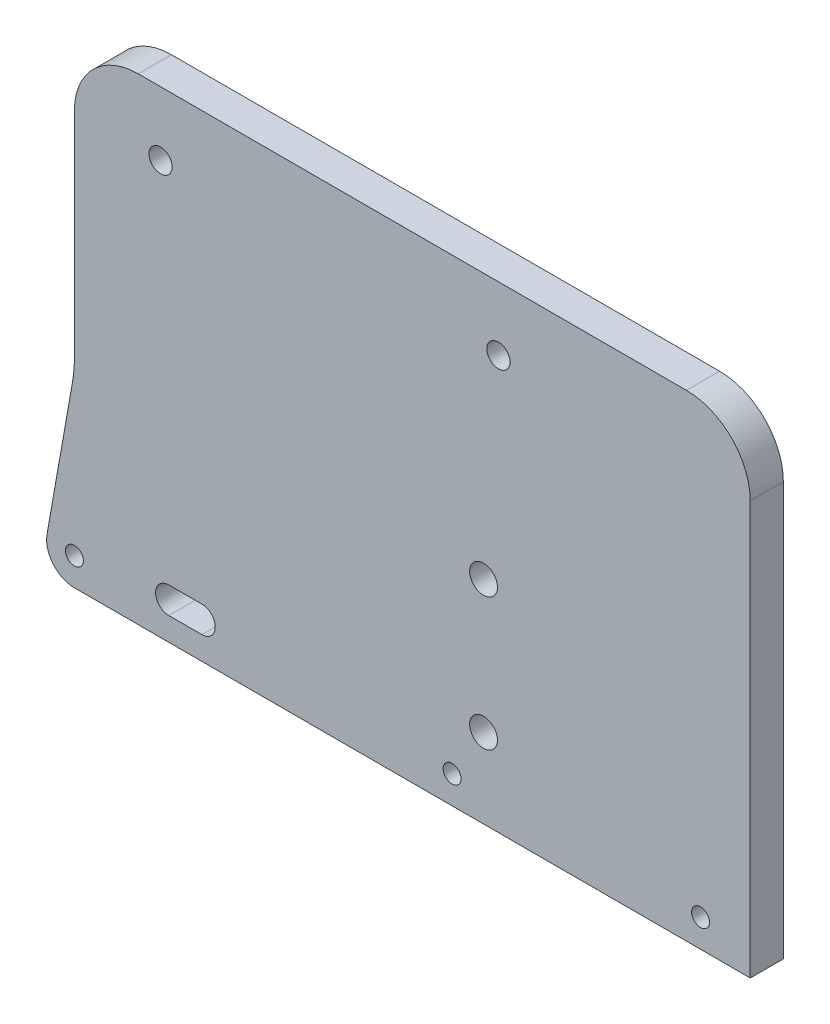
ISO-10303-21;
HEADER;
FILE_DESCRIPTION(('STEP AP214'),'2;1');
FILE_NAME('part.step','',(''),(''),'','','');
FILE_SCHEMA(('AUTOMOTIVE_DESIGN { 1 0 10303 214 1 1 1 1 }'));
ENDSEC;
DATA;
#1=APPLICATION_CONTEXT('core data for automotive mechanical design processes');
#2=APPLICATION_PROTOCOL_DEFINITION('international standard','automotive_design',2000,#1);
#3=PRODUCT_CONTEXT('',#1,'mechanical');
#4=PRODUCT('Part','Part','',(#3));
#5=PRODUCT_RELATED_PRODUCT_CATEGORY('part','',(#4));
#6=PRODUCT_DEFINITION_FORMATION('','',#4);
#7=PRODUCT_DEFINITION_CONTEXT('part definition',#1,'design');
#8=PRODUCT_DEFINITION('design','',#6,#7);
#9=PRODUCT_DEFINITION_SHAPE('','',#8);
#10=(LENGTH_UNIT() NAMED_UNIT(*) SI_UNIT(.MILLI.,.METRE.));
#11=(NAMED_UNIT(*) PLANE_ANGLE_UNIT() SI_UNIT($,.RADIAN.));
#12=(NAMED_UNIT(*) SI_UNIT($,.STERADIAN.) SOLID_ANGLE_UNIT());
#13=UNCERTAINTY_MEASURE_WITH_UNIT(LENGTH_MEASURE(1.E-05),#10,'distance_accuracy_value','');
#14=(GEOMETRIC_REPRESENTATION_CONTEXT(3) GLOBAL_UNCERTAINTY_ASSIGNED_CONTEXT((#13)) GLOBAL_UNIT_ASSIGNED_CONTEXT((#10,
#11,#12)) REPRESENTATION_CONTEXT('',''));
#15=CARTESIAN_POINT('',(0.,0.,0.));
#16=DIRECTION('',(0.,0.,1.));
#17=DIRECTION('',(1.,0.,0.));
#18=AXIS2_PLACEMENT_3D('',#15,#16,#17);
#19=CARTESIAN_POINT('',(30.62,50.37,5.));
#20=DIRECTION('',(0.,0.,1.));
#21=DIRECTION('',(1.,0.,0.));
#22=AXIS2_PLACEMENT_3D('',#19,#20,#21);
#23=PLANE('',#22);
#24=CARTESIAN_POINT('',(0.,20.,5.));
#25=DIRECTION('',(0.,0.,1.));
#26=DIRECTION('',(1.,0.,0.));
#27=AXIS2_PLACEMENT_3D('',#24,#25,#26);
#28=CIRCLE('',#27,2.1);
#29=CARTESIAN_POINT('',(2.1,20.,5.));
#30=VERTEX_POINT('',#29);
#31=EDGE_CURVE('E191',#30,#30,#28,.T.);
#32=ORIENTED_EDGE('',*,*,#31,.F.);
#33=EDGE_LOOP('',(#32));
#34=FACE_BOUND('',#33,.T.);
#35=CARTESIAN_POINT('',(-61.75,-7.8,5.));
#36=DIRECTION('',(0.,0.,1.));
#37=DIRECTION('',(1.,0.,0.));
#38=AXIS2_PLACEMENT_3D('',#35,#36,#37);
#39=CIRCLE('',#38,1.35);
#40=CARTESIAN_POINT('',(-60.4,-7.8,5.));
#41=VERTEX_POINT('',#40);
#42=EDGE_CURVE('E207',#41,#41,#39,.T.);
#43=ORIENTED_EDGE('',*,*,#42,.F.);
#44=EDGE_LOOP('',(#43));
#45=FACE_BOUND('',#44,.T.);
#46=CARTESIAN_POINT('',(2.25,50.37,5.));
#47=DIRECTION('',(0.,0.,1.));
#48=DIRECTION('',(-1.,0.,0.));
#49=AXIS2_PLACEMENT_3D('',#46,#47,#48);
#50=CIRCLE('',#49,1.75);
#51=CARTESIAN_POINT('',(0.499999999999995,50.37,5.));
#52=VERTEX_POINT('',#51);
#53=EDGE_CURVE('E219',#52,#52,#50,.T.);
#54=ORIENTED_EDGE('',*,*,#53,.F.);
#55=EDGE_LOOP('',(#54));
#56=FACE_BOUND('',#55,.T.);
#57=CARTESIAN_POINT('',(0.,0.,5.));
#58=DIRECTION('',(0.,0.,1.));
#59=DIRECTION('',(1.,0.,0.));
#60=AXIS2_PLACEMENT_3D('',#57,#58,#59);
#61=CIRCLE('',#60,2.1);
#62=CARTESIAN_POINT('',(2.1,0.,5.));
#63=VERTEX_POINT('',#62);
#64=EDGE_CURVE('E235',#63,#63,#61,.T.);
#65=ORIENTED_EDGE('',*,*,#64,.F.);
#66=EDGE_LOOP('',(#65));
#67=FACE_BOUND('',#66,.T.);
#68=CARTESIAN_POINT('',(30.62,50.37,5.));
#69=DIRECTION('',(0.,0.,1.));
#70=DIRECTION('',(1.,0.,0.));
#71=AXIS2_PLACEMENT_3D('',#68,#69,#70);
#72=CIRCLE('',#71,9.63);
#73=CARTESIAN_POINT('',(40.25,50.37,5.));
#74=VERTEX_POINT('',#73);
#75=CARTESIAN_POINT('',(30.62,60.,5.));
#76=VERTEX_POINT('',#75);
#77=EDGE_CURVE('E243',#74,#76,#72,.T.);
#78=ORIENTED_EDGE('',*,*,#77,.T.);
#79=DIRECTION('',(-1.,0.,0.));
#80=VECTOR('',#79,1.);
#81=CARTESIAN_POINT('',(-52.12,60.,5.));
#82=LINE('',#81,#80);
#83=CARTESIAN_POINT('',(-52.12,60.,5.));
#84=VERTEX_POINT('',#83);
#85=EDGE_CURVE('E246',#76,#84,#82,.T.);
#86=ORIENTED_EDGE('',*,*,#85,.T.);
#87=CARTESIAN_POINT('',(-52.12,50.37,5.));
#88=DIRECTION('',(0.,0.,1.));
#89=DIRECTION('',(1.,0.,0.));
#90=AXIS2_PLACEMENT_3D('',#87,#88,#89);
#91=CIRCLE('',#90,9.63);
#92=CARTESIAN_POINT('',(-61.75,50.37,5.));
#93=VERTEX_POINT('',#92);
#94=EDGE_CURVE('E250',#84,#93,#91,.T.);
#95=ORIENTED_EDGE('',*,*,#94,.T.);
#96=DIRECTION('',(0.,-1.,0.));
#97=VECTOR('',#96,1.);
#98=CARTESIAN_POINT('',(-61.75,18.1366092997226,5.));
#99=LINE('',#98,#97);
#100=CARTESIAN_POINT('',(-61.75,18.1366092997226,5.));
#101=VERTEX_POINT('',#100);
#102=EDGE_CURVE('E253',#93,#101,#99,.T.);
#103=ORIENTED_EDGE('',*,*,#102,.T.);
#104=CARTESIAN_POINT('',(-81.75,18.1366092997226,5.));
#105=DIRECTION('',(0.,0.,-1.));
#106=DIRECTION('',(1.,0.,0.));
#107=AXIS2_PLACEMENT_3D('',#104,#105,#106);
#108=CIRCLE('',#107,20.);
#109=CARTESIAN_POINT('',(-62.0538449397558,14.6636457463841,5.));
#110=VERTEX_POINT('',#109);
#111=EDGE_CURVE('E256',#101,#110,#108,.T.);
#112=ORIENTED_EDGE('',*,*,#111,.T.);
#113=DIRECTION('',(-0.173648177666923,-0.984807753012209,0.));
#114=VECTOR('',#113,1.);
#115=CARTESIAN_POINT('',(-62.0538449397558,14.6636457463841,5.));
#116=LINE('',#115,#114);
#117=CARTESIAN_POINT('',(-65.8861925626513,-7.07067765379892,5.));
#118=VERTEX_POINT('',#117);
#119=EDGE_CURVE('E259',#110,#118,#116,.T.);
#120=ORIENTED_EDGE('',*,*,#119,.T.);
#121=CARTESIAN_POINT('',(-61.75,-7.8,5.));
#122=DIRECTION('',(0.,0.,1.));
#123=DIRECTION('',(1.,0.,0.));
#124=AXIS2_PLACEMENT_3D('',#121,#122,#123);
#125=CIRCLE('',#124,4.2);
#126=CARTESIAN_POINT('',(-61.75,-12.,5.));
#127=VERTEX_POINT('',#126);
#128=EDGE_CURVE('E262',#118,#127,#125,.T.);
#129=ORIENTED_EDGE('',*,*,#128,.T.);
#130=DIRECTION('',(1.,0.,0.));
#131=VECTOR('',#130,1.);
#132=CARTESIAN_POINT('',(-61.75,-12.,5.));
#133=LINE('',#132,#131);
#134=CARTESIAN_POINT('',(40.25,-12.,5.));
#135=VERTEX_POINT('',#134);
#136=EDGE_CURVE('E264',#127,#135,#133,.T.);
#137=ORIENTED_EDGE('',*,*,#136,.T.);
#138=DIRECTION('',(0.,1.,0.));
#139=VECTOR('',#138,1.);
#140=CARTESIAN_POINT('',(40.25,-12.,5.));
#141=LINE('',#140,#139);
#142=EDGE_CURVE('E267',#135,#74,#141,.T.);
#143=ORIENTED_EDGE('',*,*,#142,.T.);
#144=EDGE_LOOP('',(#78,#86,#95,#103,#112,#120,#129,#137,#143));
#145=FACE_BOUND('',#144,.T.);
#146=CARTESIAN_POINT('',(-48.75,50.37,5.));
#147=DIRECTION('',(0.,0.,1.));
#148=DIRECTION('',(1.,0.,0.));
#149=AXIS2_PLACEMENT_3D('',#146,#147,#148);
#150=CIRCLE('',#149,1.75);
#151=CARTESIAN_POINT('',(-47.,50.37,5.));
#152=VERTEX_POINT('',#151);
#153=EDGE_CURVE('E227',#152,#152,#150,.T.);
#154=ORIENTED_EDGE('',*,*,#153,.F.);
#155=EDGE_LOOP('',(#154));
#156=FACE_BOUND('',#155,.T.);
#157=CARTESIAN_POINT('',(32.75,-7.8,5.));
#158=DIRECTION('',(0.,0.,1.));
#159=DIRECTION('',(1.,0.,0.));
#160=AXIS2_PLACEMENT_3D('',#157,#158,#159);
#161=CIRCLE('',#160,1.35);
#162=CARTESIAN_POINT('',(34.1,-7.8,5.));
#163=VERTEX_POINT('',#162);
#164=EDGE_CURVE('E213',#163,#163,#161,.T.);
#165=ORIENTED_EDGE('',*,*,#164,.F.);
#166=EDGE_LOOP('',(#165));
#167=FACE_BOUND('',#166,.T.);
#168=CARTESIAN_POINT('',(-4.75,-7.8,5.));
#169=DIRECTION('',(0.,0.,1.));
#170=DIRECTION('',(1.,0.,0.));
#171=AXIS2_PLACEMENT_3D('',#168,#169,#170);
#172=CIRCLE('',#171,1.35);
#173=CARTESIAN_POINT('',(-3.4,-7.8,5.));
#174=VERTEX_POINT('',#173);
#175=EDGE_CURVE('E199',#174,#174,#172,.T.);
#176=ORIENTED_EDGE('',*,*,#175,.F.);
#177=EDGE_LOOP('',(#176));
#178=FACE_BOUND('',#177,.T.);
#179=DIRECTION('',(1.,0.,0.));
#180=VECTOR('',#179,1.);
#181=CARTESIAN_POINT('',(-47.5,-8.5,5.));
#182=LINE('',#181,#180);
#183=CARTESIAN_POINT('',(-47.5,-8.5,5.));
#184=VERTEX_POINT('',#183);
#185=CARTESIAN_POINT('',(-42.5,-8.5,5.));
#186=VERTEX_POINT('',#185);
#187=EDGE_CURVE('E156',#184,#186,#182,.T.);
#188=ORIENTED_EDGE('',*,*,#187,.F.);
#189=CARTESIAN_POINT('',(-47.5,-6.5,5.));
#190=DIRECTION('',(0.,0.,1.));
#191=DIRECTION('',(1.,0.,0.));
#192=AXIS2_PLACEMENT_3D('',#189,#190,#191);
#193=CIRCLE('',#192,2.);
#194=CARTESIAN_POINT('',(-47.5,-4.5,5.));
#195=VERTEX_POINT('',#194);
#196=EDGE_CURVE('E148',#195,#184,#193,.T.);
#197=ORIENTED_EDGE('',*,*,#196,.F.);
#198=DIRECTION('',(-1.,0.,0.));
#199=VECTOR('',#198,1.);
#200=CARTESIAN_POINT('',(-47.5,-4.5,5.));
#201=LINE('',#200,#199);
#202=CARTESIAN_POINT('',(-42.5,-4.5,5.));
#203=VERTEX_POINT('',#202);
#204=EDGE_CURVE('E171',#203,#195,#201,.T.);
#205=ORIENTED_EDGE('',*,*,#204,.F.);
#206=CARTESIAN_POINT('',(-42.5,-6.5,5.));
#207=DIRECTION('',(0.,0.,1.));
#208=DIRECTION('',(1.,0.,0.));
#209=AXIS2_PLACEMENT_3D('',#206,#207,#208);
#210=CIRCLE('',#209,2.);
#211=EDGE_CURVE('E168',#186,#203,#210,.T.);
#212=ORIENTED_EDGE('',*,*,#211,.F.);
#213=EDGE_LOOP('',(#188,#197,#205,#212));
#214=FACE_BOUND('',#213,.T.);
#215=ADVANCED_FACE('F41',(#34,#45,#56,#67,#145,#156,#167,#178,#214),#23,.T.);
#216=CARTESIAN_POINT('',(30.62,50.37,0.));
#217=DIRECTION('',(0.,0.,1.));
#218=DIRECTION('',(1.,0.,0.));
#219=AXIS2_PLACEMENT_3D('',#216,#217,#218);
#220=PLANE('',#219);
#221=CARTESIAN_POINT('',(0.,20.,0.));
#222=DIRECTION('',(0.,0.,1.));
#223=DIRECTION('',(1.,0.,0.));
#224=AXIS2_PLACEMENT_3D('',#221,#222,#223);
#225=CIRCLE('',#224,2.1);
#226=CARTESIAN_POINT('',(2.1,20.,0.));
#227=VERTEX_POINT('',#226);
#228=EDGE_CURVE('E164',#227,#227,#225,.T.);
#229=ORIENTED_EDGE('',*,*,#228,.T.);
#230=EDGE_LOOP('',(#229));
#231=FACE_BOUND('',#230,.T.);
#232=CARTESIAN_POINT('',(-61.75,-7.8,0.));
#233=DIRECTION('',(0.,0.,1.));
#234=DIRECTION('',(1.,0.,0.));
#235=AXIS2_PLACEMENT_3D('',#232,#233,#234);
#236=CIRCLE('',#235,1.35);
#237=CARTESIAN_POINT('',(-60.4,-7.8,0.));
#238=VERTEX_POINT('',#237);
#239=EDGE_CURVE('E203',#238,#238,#236,.T.);
#240=ORIENTED_EDGE('',*,*,#239,.T.);
#241=EDGE_LOOP('',(#240));
#242=FACE_BOUND('',#241,.T.);
#243=CARTESIAN_POINT('',(2.25,50.37,0.));
#244=DIRECTION('',(0.,0.,1.));
#245=DIRECTION('',(-1.,0.,0.));
#246=AXIS2_PLACEMENT_3D('',#243,#244,#245);
#247=CIRCLE('',#246,1.75);
#248=CARTESIAN_POINT('',(0.499999999999995,50.37,0.));
#249=VERTEX_POINT('',#248);
#250=EDGE_CURVE('E216',#249,#249,#247,.T.);
#251=ORIENTED_EDGE('',*,*,#250,.T.);
#252=EDGE_LOOP('',(#251));
#253=FACE_BOUND('',#252,.T.);
#254=CARTESIAN_POINT('',(0.,0.,0.));
#255=DIRECTION('',(0.,0.,1.));
#256=DIRECTION('',(1.,0.,0.));
#257=AXIS2_PLACEMENT_3D('',#254,#255,#256);
#258=CIRCLE('',#257,2.1);
#259=CARTESIAN_POINT('',(2.1,0.,0.));
#260=VERTEX_POINT('',#259);
#261=EDGE_CURVE('E231',#260,#260,#258,.T.);
#262=ORIENTED_EDGE('',*,*,#261,.T.);
#263=EDGE_LOOP('',(#262));
#264=FACE_BOUND('',#263,.T.);
#265=CARTESIAN_POINT('',(30.62,50.37,0.));
#266=DIRECTION('',(0.,0.,1.));
#267=DIRECTION('',(1.,0.,0.));
#268=AXIS2_PLACEMENT_3D('',#265,#266,#267);
#269=CIRCLE('',#268,9.63);
#270=CARTESIAN_POINT('',(40.25,50.37,0.));
#271=VERTEX_POINT('',#270);
#272=CARTESIAN_POINT('',(30.62,60.,0.));
#273=VERTEX_POINT('',#272);
#274=EDGE_CURVE('E239',#271,#273,#269,.T.);
#275=ORIENTED_EDGE('',*,*,#274,.F.);
#276=DIRECTION('',(0.,1.,0.));
#277=VECTOR('',#276,1.);
#278=CARTESIAN_POINT('',(40.25,-12.,0.));
#279=LINE('',#278,#277);
#280=CARTESIAN_POINT('',(40.25,-12.,0.));
#281=VERTEX_POINT('',#280);
#282=EDGE_CURVE('E247',#281,#271,#279,.T.);
#283=ORIENTED_EDGE('',*,*,#282,.F.);
#284=DIRECTION('',(1.,0.,0.));
#285=VECTOR('',#284,1.);
#286=CARTESIAN_POINT('',(-61.75,-12.,0.));
#287=LINE('',#286,#285);
#288=CARTESIAN_POINT('',(-61.75,-12.,0.));
#289=VERTEX_POINT('',#288);
#290=EDGE_CURVE('E290',#289,#281,#287,.T.);
#291=ORIENTED_EDGE('',*,*,#290,.F.);
#292=CARTESIAN_POINT('',(-61.75,-7.8,0.));
#293=DIRECTION('',(0.,0.,1.));
#294=DIRECTION('',(1.,0.,0.));
#295=AXIS2_PLACEMENT_3D('',#292,#293,#294);
#296=CIRCLE('',#295,4.2);
#297=CARTESIAN_POINT('',(-65.8861925626513,-7.07067765379892,0.));
#298=VERTEX_POINT('',#297);
#299=EDGE_CURVE('E288',#298,#289,#296,.T.);
#300=ORIENTED_EDGE('',*,*,#299,.F.);
#301=DIRECTION('',(-0.173648177666923,-0.984807753012209,0.));
#302=VECTOR('',#301,1.);
#303=CARTESIAN_POINT('',(-62.0538449397558,14.6636457463841,0.));
#304=LINE('',#303,#302);
#305=CARTESIAN_POINT('',(-62.0538449397558,14.6636457463841,0.));
#306=VERTEX_POINT('',#305);
#307=EDGE_CURVE('E285',#306,#298,#304,.T.);
#308=ORIENTED_EDGE('',*,*,#307,.F.);
#309=CARTESIAN_POINT('',(-81.75,18.1366092997226,0.));
#310=DIRECTION('',(0.,0.,-1.));
#311=DIRECTION('',(1.,0.,0.));
#312=AXIS2_PLACEMENT_3D('',#309,#310,#311);
#313=CIRCLE('',#312,20.);
#314=CARTESIAN_POINT('',(-61.75,18.1366092997226,0.));
#315=VERTEX_POINT('',#314);
#316=EDGE_CURVE('E282',#315,#306,#313,.T.);
#317=ORIENTED_EDGE('',*,*,#316,.F.);
#318=DIRECTION('',(0.,-1.,0.));
#319=VECTOR('',#318,1.);
#320=CARTESIAN_POINT('',(-61.75,18.1366092997226,0.));
#321=LINE('',#320,#319);
#322=CARTESIAN_POINT('',(-61.75,50.37,0.));
#323=VERTEX_POINT('',#322);
#324=EDGE_CURVE('E279',#323,#315,#321,.T.);
#325=ORIENTED_EDGE('',*,*,#324,.F.);
#326=CARTESIAN_POINT('',(-52.12,50.37,0.));
#327=DIRECTION('',(0.,0.,1.));
#328=DIRECTION('',(1.,0.,0.));
#329=AXIS2_PLACEMENT_3D('',#326,#327,#328);
#330=CIRCLE('',#329,9.63);
#331=CARTESIAN_POINT('',(-52.12,60.,0.));
#332=VERTEX_POINT('',#331);
#333=EDGE_CURVE('E276',#332,#323,#330,.T.);
#334=ORIENTED_EDGE('',*,*,#333,.F.);
#335=DIRECTION('',(-1.,0.,0.));
#336=VECTOR('',#335,1.);
#337=CARTESIAN_POINT('',(-52.12,60.,0.));
#338=LINE('',#337,#336);
#339=EDGE_CURVE('E273',#273,#332,#338,.T.);
#340=ORIENTED_EDGE('',*,*,#339,.F.);
#341=EDGE_LOOP('',(#275,#283,#291,#300,#308,#317,#325,#334,#340));
#342=FACE_BOUND('',#341,.T.);
#343=CARTESIAN_POINT('',(-48.75,50.37,0.));
#344=DIRECTION('',(0.,0.,1.));
#345=DIRECTION('',(1.,0.,0.));
#346=AXIS2_PLACEMENT_3D('',#343,#344,#345);
#347=CIRCLE('',#346,1.75);
#348=CARTESIAN_POINT('',(-47.,50.37,0.));
#349=VERTEX_POINT('',#348);
#350=EDGE_CURVE('E223',#349,#349,#347,.T.);
#351=ORIENTED_EDGE('',*,*,#350,.T.);
#352=EDGE_LOOP('',(#351));
#353=FACE_BOUND('',#352,.T.);
#354=CARTESIAN_POINT('',(32.75,-7.8,0.));
#355=DIRECTION('',(0.,0.,1.));
#356=DIRECTION('',(1.,0.,0.));
#357=AXIS2_PLACEMENT_3D('',#354,#355,#356);
#358=CIRCLE('',#357,1.35);
#359=CARTESIAN_POINT('',(34.1,-7.8,0.));
#360=VERTEX_POINT('',#359);
#361=EDGE_CURVE('E210',#360,#360,#358,.T.);
#362=ORIENTED_EDGE('',*,*,#361,.T.);
#363=EDGE_LOOP('',(#362));
#364=FACE_BOUND('',#363,.T.);
#365=CARTESIAN_POINT('',(-4.75,-7.8,0.));
#366=DIRECTION('',(0.,0.,1.));
#367=DIRECTION('',(1.,0.,0.));
#368=AXIS2_PLACEMENT_3D('',#365,#366,#367);
#369=CIRCLE('',#368,1.35);
#370=CARTESIAN_POINT('',(-3.4,-7.8,0.));
#371=VERTEX_POINT('',#370);
#372=EDGE_CURVE('E195',#371,#371,#369,.T.);
#373=ORIENTED_EDGE('',*,*,#372,.T.);
#374=EDGE_LOOP('',(#373));
#375=FACE_BOUND('',#374,.T.);
#376=CARTESIAN_POINT('',(-47.5,-6.5,0.));
#377=DIRECTION('',(0.,0.,1.));
#378=DIRECTION('',(1.,0.,0.));
#379=AXIS2_PLACEMENT_3D('',#376,#377,#378);
#380=CIRCLE('',#379,2.);
#381=CARTESIAN_POINT('',(-47.5,-4.5,0.));
#382=VERTEX_POINT('',#381);
#383=CARTESIAN_POINT('',(-47.5,-8.5,0.));
#384=VERTEX_POINT('',#383);
#385=EDGE_CURVE('E69',#382,#384,#380,.T.);
#386=ORIENTED_EDGE('',*,*,#385,.T.);
#387=DIRECTION('',(1.,0.,0.));
#388=VECTOR('',#387,1.);
#389=CARTESIAN_POINT('',(-47.5,-8.5,0.));
#390=LINE('',#389,#388);
#391=CARTESIAN_POINT('',(-42.5,-8.5,0.));
#392=VERTEX_POINT('',#391);
#393=EDGE_CURVE('E163',#384,#392,#390,.T.);
#394=ORIENTED_EDGE('',*,*,#393,.T.);
#395=CARTESIAN_POINT('',(-42.5,-6.5,0.));
#396=DIRECTION('',(0.,0.,1.));
#397=DIRECTION('',(1.,0.,0.));
#398=AXIS2_PLACEMENT_3D('',#395,#396,#397);
#399=CIRCLE('',#398,2.);
#400=CARTESIAN_POINT('',(-42.5,-4.5,0.));
#401=VERTEX_POINT('',#400);
#402=EDGE_CURVE('E179',#392,#401,#399,.T.);
#403=ORIENTED_EDGE('',*,*,#402,.T.);
#404=DIRECTION('',(-1.,0.,0.));
#405=VECTOR('',#404,1.);
#406=CARTESIAN_POINT('',(-47.5,-4.5,0.));
#407=LINE('',#406,#405);
#408=EDGE_CURVE('E157',#401,#382,#407,.T.);
#409=ORIENTED_EDGE('',*,*,#408,.T.);
#410=EDGE_LOOP('',(#386,#394,#403,#409));
#411=FACE_BOUND('',#410,.T.);
#412=ADVANCED_FACE('F330',(#231,#242,#253,#264,#342,#353,#364,#375,#411),#220,.F.);
#413=CARTESIAN_POINT('',(30.62,50.37,5.));
#414=DIRECTION('',(0.,0.,-1.));
#415=DIRECTION('',(-1.,0.,0.));
#416=AXIS2_PLACEMENT_3D('',#413,#414,#415);
#417=CYLINDRICAL_SURFACE('',#416,9.63);
#418=ORIENTED_EDGE('',*,*,#274,.T.);
#419=DIRECTION('',(0.,0.,-1.));
#420=VECTOR('',#419,1.);
#421=CARTESIAN_POINT('',(30.62,60.,5.));
#422=LINE('',#421,#420);
#423=EDGE_CURVE('E11',#76,#273,#422,.T.);
#424=ORIENTED_EDGE('',*,*,#423,.F.);
#425=ORIENTED_EDGE('',*,*,#77,.F.);
#426=DIRECTION('',(0.,0.,-1.));
#427=VECTOR('',#426,1.);
#428=CARTESIAN_POINT('',(40.25,50.37,5.));
#429=LINE('',#428,#427);
#430=EDGE_CURVE('E269',#74,#271,#429,.T.);
#431=ORIENTED_EDGE('',*,*,#430,.T.);
#432=EDGE_LOOP('',(#418,#424,#425,#431));
#433=FACE_BOUND('',#432,.T.);
#434=ADVANCED_FACE('F43',(#433),#417,.T.);
#435=CARTESIAN_POINT('',(-52.12,60.,5.));
#436=DIRECTION('',(0.,-1.,0.));
#437=DIRECTION('',(0.,0.,-1.));
#438=AXIS2_PLACEMENT_3D('',#435,#436,#437);
#439=PLANE('',#438);
#440=ORIENTED_EDGE('',*,*,#339,.T.);
#441=DIRECTION('',(0.,0.,-1.));
#442=VECTOR('',#441,1.);
#443=CARTESIAN_POINT('',(-52.12,60.,5.));
#444=LINE('',#443,#442);
#445=EDGE_CURVE('E49',#84,#332,#444,.T.);
#446=ORIENTED_EDGE('',*,*,#445,.F.);
#447=ORIENTED_EDGE('',*,*,#85,.F.);
#448=ORIENTED_EDGE('',*,*,#423,.T.);
#449=EDGE_LOOP('',(#440,#446,#447,#448));
#450=FACE_BOUND('',#449,.T.);
#451=ADVANCED_FACE('F348',(#450),#439,.F.);
#452=CARTESIAN_POINT('',(-52.12,50.37,5.));
#453=DIRECTION('',(0.,0.,-1.));
#454=DIRECTION('',(-1.,0.,0.));
#455=AXIS2_PLACEMENT_3D('',#452,#453,#454);
#456=CYLINDRICAL_SURFACE('',#455,9.63);
#457=ORIENTED_EDGE('',*,*,#333,.T.);
#458=DIRECTION('',(0.,0.,-1.));
#459=VECTOR('',#458,1.);
#460=CARTESIAN_POINT('',(-61.75,50.37,5.));
#461=LINE('',#460,#459);
#462=EDGE_CURVE('E315',#93,#323,#461,.T.);
#463=ORIENTED_EDGE('',*,*,#462,.F.);
#464=ORIENTED_EDGE('',*,*,#94,.F.);
#465=ORIENTED_EDGE('',*,*,#445,.T.);
#466=EDGE_LOOP('',(#457,#463,#464,#465));
#467=FACE_BOUND('',#466,.T.);
#468=ADVANCED_FACE('F324',(#467),#456,.T.);
#469=CARTESIAN_POINT('',(-61.75,18.1366092997226,5.));
#470=DIRECTION('',(1.,0.,0.));
#471=DIRECTION('',(0.,1.,0.));
#472=AXIS2_PLACEMENT_3D('',#469,#470,#471);
#473=PLANE('',#472);
#474=ORIENTED_EDGE('',*,*,#324,.T.);
#475=DIRECTION('',(0.,0.,-1.));
#476=VECTOR('',#475,1.);
#477=CARTESIAN_POINT('',(-61.75,18.1366092997226,5.));
#478=LINE('',#477,#476);
#479=EDGE_CURVE('E311',#101,#315,#478,.T.);
#480=ORIENTED_EDGE('',*,*,#479,.F.);
#481=ORIENTED_EDGE('',*,*,#102,.F.);
#482=ORIENTED_EDGE('',*,*,#462,.T.);
#483=EDGE_LOOP('',(#474,#480,#481,#482));
#484=FACE_BOUND('',#483,.T.);
#485=ADVANCED_FACE('F336',(#484),#473,.F.);
#486=CARTESIAN_POINT('',(-81.75,18.1366092997226,5.));
#487=DIRECTION('',(0.,0.,-1.));
#488=DIRECTION('',(-1.,0.,0.));
#489=AXIS2_PLACEMENT_3D('',#486,#487,#488);
#490=CYLINDRICAL_SURFACE('',#489,20.);
#491=ORIENTED_EDGE('',*,*,#316,.T.);
#492=DIRECTION('',(0.,0.,-1.));
#493=VECTOR('',#492,1.);
#494=CARTESIAN_POINT('',(-62.0538449397558,14.6636457463841,5.));
#495=LINE('',#494,#493);
#496=EDGE_CURVE('E307',#110,#306,#495,.T.);
#497=ORIENTED_EDGE('',*,*,#496,.F.);
#498=ORIENTED_EDGE('',*,*,#111,.F.);
#499=ORIENTED_EDGE('',*,*,#479,.T.);
#500=EDGE_LOOP('',(#491,#497,#498,#499));
#501=FACE_BOUND('',#500,.T.);
#502=ADVANCED_FACE('F340',(#501),#490,.F.);
#503=CARTESIAN_POINT('',(-62.0538449397558,14.6636457463841,5.));
#504=DIRECTION('',(0.984807753012209,-0.173648177666923,0.));
#505=DIRECTION('',(0.173648177666923,0.984807753012209,0.));
#506=AXIS2_PLACEMENT_3D('',#503,#504,#505);
#507=PLANE('',#506);
#508=ORIENTED_EDGE('',*,*,#307,.T.);
#509=DIRECTION('',(0.,0.,-1.));
#510=VECTOR('',#509,1.);
#511=CARTESIAN_POINT('',(-65.8861925626513,-7.07067765379892,5.));
#512=LINE('',#511,#510);
#513=EDGE_CURVE('E304',#118,#298,#512,.T.);
#514=ORIENTED_EDGE('',*,*,#513,.F.);
#515=ORIENTED_EDGE('',*,*,#119,.F.);
#516=ORIENTED_EDGE('',*,*,#496,.T.);
#517=EDGE_LOOP('',(#508,#514,#515,#516));
#518=FACE_BOUND('',#517,.T.);
#519=ADVANCED_FACE('F366',(#518),#507,.F.);
#520=CARTESIAN_POINT('',(-61.75,-7.8,5.));
#521=DIRECTION('',(0.,0.,-1.));
#522=DIRECTION('',(-1.,0.,0.));
#523=AXIS2_PLACEMENT_3D('',#520,#521,#522);
#524=CYLINDRICAL_SURFACE('',#523,4.2);
#525=ORIENTED_EDGE('',*,*,#299,.T.);
#526=DIRECTION('',(0.,0.,-1.));
#527=VECTOR('',#526,1.);
#528=CARTESIAN_POINT('',(-61.75,-12.,5.));
#529=LINE('',#528,#527);
#530=EDGE_CURVE('E301',#127,#289,#529,.T.);
#531=ORIENTED_EDGE('',*,*,#530,.F.);
#532=ORIENTED_EDGE('',*,*,#128,.F.);
#533=ORIENTED_EDGE('',*,*,#513,.T.);
#534=EDGE_LOOP('',(#525,#531,#532,#533));
#535=FACE_BOUND('',#534,.T.);
#536=ADVANCED_FACE('F364',(#535),#524,.T.);
#537=CARTESIAN_POINT('',(-61.75,-12.,5.));
#538=DIRECTION('',(0.,1.,0.));
#539=DIRECTION('',(0.,0.,1.));
#540=AXIS2_PLACEMENT_3D('',#537,#538,#539);
#541=PLANE('',#540);
#542=ORIENTED_EDGE('',*,*,#290,.T.);
#543=DIRECTION('',(0.,0.,-1.));
#544=VECTOR('',#543,1.);
#545=CARTESIAN_POINT('',(40.25,-12.,5.));
#546=LINE('',#545,#544);
#547=EDGE_CURVE('E298',#135,#281,#546,.T.);
#548=ORIENTED_EDGE('',*,*,#547,.F.);
#549=ORIENTED_EDGE('',*,*,#136,.F.);
#550=ORIENTED_EDGE('',*,*,#530,.T.);
#551=EDGE_LOOP('',(#542,#548,#549,#550));
#552=FACE_BOUND('',#551,.T.);
#553=ADVANCED_FACE('F360',(#552),#541,.F.);
#554=CARTESIAN_POINT('',(40.25,-12.,5.));
#555=DIRECTION('',(-1.,0.,0.));
#556=DIRECTION('',(0.,0.,1.));
#557=AXIS2_PLACEMENT_3D('',#554,#555,#556);
#558=PLANE('',#557);
#559=ORIENTED_EDGE('',*,*,#282,.T.);
#560=ORIENTED_EDGE('',*,*,#430,.F.);
#561=ORIENTED_EDGE('',*,*,#142,.F.);
#562=ORIENTED_EDGE('',*,*,#547,.T.);
#563=EDGE_LOOP('',(#559,#560,#561,#562));
#564=FACE_BOUND('',#563,.T.);
#565=ADVANCED_FACE('F355',(#564),#558,.F.);
#566=CARTESIAN_POINT('',(0.,0.,5.));
#567=DIRECTION('',(0.,0.,-1.));
#568=DIRECTION('',(-1.,0.,0.));
#569=AXIS2_PLACEMENT_3D('',#566,#567,#568);
#570=CYLINDRICAL_SURFACE('',#569,2.1);
#571=ORIENTED_EDGE('',*,*,#64,.T.);
#572=EDGE_LOOP('',(#571));
#573=FACE_BOUND('',#572,.T.);
#574=ORIENTED_EDGE('',*,*,#261,.F.);
#575=EDGE_LOOP('',(#574));
#576=FACE_BOUND('',#575,.T.);
#577=ADVANCED_FACE('F386',(#573,#576),#570,.F.);
#578=CARTESIAN_POINT('',(-48.75,50.37,5.));
#579=DIRECTION('',(0.,0.,-1.));
#580=DIRECTION('',(-1.,0.,0.));
#581=AXIS2_PLACEMENT_3D('',#578,#579,#580);
#582=CYLINDRICAL_SURFACE('',#581,1.75);
#583=ORIENTED_EDGE('',*,*,#153,.T.);
#584=EDGE_LOOP('',(#583));
#585=FACE_BOUND('',#584,.T.);
#586=ORIENTED_EDGE('',*,*,#350,.F.);
#587=EDGE_LOOP('',(#586));
#588=FACE_BOUND('',#587,.T.);
#589=ADVANCED_FACE('F407',(#585,#588),#582,.F.);
#590=CARTESIAN_POINT('',(2.25,50.37,5.));
#591=DIRECTION('',(0.,0.,-1.));
#592=DIRECTION('',(-1.,0.,0.));
#593=AXIS2_PLACEMENT_3D('',#590,#591,#592);
#594=CYLINDRICAL_SURFACE('',#593,1.75);
#595=ORIENTED_EDGE('',*,*,#53,.T.);
#596=EDGE_LOOP('',(#595));
#597=FACE_BOUND('',#596,.T.);
#598=ORIENTED_EDGE('',*,*,#250,.F.);
#599=EDGE_LOOP('',(#598));
#600=FACE_BOUND('',#599,.T.);
#601=ADVANCED_FACE('F414',(#597,#600),#594,.F.);
#602=CARTESIAN_POINT('',(32.75,-7.8,5.));
#603=DIRECTION('',(0.,0.,-1.));
#604=DIRECTION('',(-1.,0.,0.));
#605=AXIS2_PLACEMENT_3D('',#602,#603,#604);
#606=CYLINDRICAL_SURFACE('',#605,1.35);
#607=ORIENTED_EDGE('',*,*,#164,.T.);
#608=EDGE_LOOP('',(#607));
#609=FACE_BOUND('',#608,.T.);
#610=ORIENTED_EDGE('',*,*,#361,.F.);
#611=EDGE_LOOP('',(#610));
#612=FACE_BOUND('',#611,.T.);
#613=ADVANCED_FACE('F421',(#609,#612),#606,.F.);
#614=CARTESIAN_POINT('',(-61.75,-7.8,5.));
#615=DIRECTION('',(0.,0.,-1.));
#616=DIRECTION('',(-1.,0.,0.));
#617=AXIS2_PLACEMENT_3D('',#614,#615,#616);
#618=CYLINDRICAL_SURFACE('',#617,1.35);
#619=ORIENTED_EDGE('',*,*,#42,.T.);
#620=EDGE_LOOP('',(#619));
#621=FACE_BOUND('',#620,.T.);
#622=ORIENTED_EDGE('',*,*,#239,.F.);
#623=EDGE_LOOP('',(#622));
#624=FACE_BOUND('',#623,.T.);
#625=ADVANCED_FACE('F429',(#621,#624),#618,.F.);
#626=CARTESIAN_POINT('',(-4.75,-7.8,5.));
#627=DIRECTION('',(0.,0.,-1.));
#628=DIRECTION('',(-1.,0.,0.));
#629=AXIS2_PLACEMENT_3D('',#626,#627,#628);
#630=CYLINDRICAL_SURFACE('',#629,1.35);
#631=ORIENTED_EDGE('',*,*,#175,.T.);
#632=EDGE_LOOP('',(#631));
#633=FACE_BOUND('',#632,.T.);
#634=ORIENTED_EDGE('',*,*,#372,.F.);
#635=EDGE_LOOP('',(#634));
#636=FACE_BOUND('',#635,.T.);
#637=ADVANCED_FACE('F437',(#633,#636),#630,.F.);
#638=CARTESIAN_POINT('',(0.,20.,5.));
#639=DIRECTION('',(0.,0.,-1.));
#640=DIRECTION('',(-1.,0.,0.));
#641=AXIS2_PLACEMENT_3D('',#638,#639,#640);
#642=CYLINDRICAL_SURFACE('',#641,2.1);
#643=ORIENTED_EDGE('',*,*,#31,.T.);
#644=EDGE_LOOP('',(#643));
#645=FACE_BOUND('',#644,.T.);
#646=ORIENTED_EDGE('',*,*,#228,.F.);
#647=EDGE_LOOP('',(#646));
#648=FACE_BOUND('',#647,.T.);
#649=ADVANCED_FACE('F445',(#645,#648),#642,.F.);
#650=CARTESIAN_POINT('',(-47.5,-6.5,5.));
#651=DIRECTION('',(0.,0.,-1.));
#652=DIRECTION('',(-1.,0.,0.));
#653=AXIS2_PLACEMENT_3D('',#650,#651,#652);
#654=CYLINDRICAL_SURFACE('',#653,2.);
#655=ORIENTED_EDGE('',*,*,#385,.F.);
#656=DIRECTION('',(0.,0.,-1.));
#657=VECTOR('',#656,1.);
#658=CARTESIAN_POINT('',(-47.5,-4.5,5.));
#659=LINE('',#658,#657);
#660=EDGE_CURVE('E152',#195,#382,#659,.T.);
#661=ORIENTED_EDGE('',*,*,#660,.F.);
#662=ORIENTED_EDGE('',*,*,#196,.T.);
#663=DIRECTION('',(0.,0.,-1.));
#664=VECTOR('',#663,1.);
#665=CARTESIAN_POINT('',(-47.5,-8.5,5.));
#666=LINE('',#665,#664);
#667=EDGE_CURVE('E151',#184,#384,#666,.T.);
#668=ORIENTED_EDGE('',*,*,#667,.T.);
#669=EDGE_LOOP('',(#655,#661,#662,#668));
#670=FACE_BOUND('',#669,.T.);
#671=ADVANCED_FACE('F150',(#670),#654,.F.);
#672=CARTESIAN_POINT('',(-47.5,-8.5,5.));
#673=DIRECTION('',(0.,1.,0.));
#674=DIRECTION('',(0.,0.,1.));
#675=AXIS2_PLACEMENT_3D('',#672,#673,#674);
#676=PLANE('',#675);
#677=ORIENTED_EDGE('',*,*,#393,.F.);
#678=ORIENTED_EDGE('',*,*,#667,.F.);
#679=ORIENTED_EDGE('',*,*,#187,.T.);
#680=DIRECTION('',(0.,0.,-1.));
#681=VECTOR('',#680,1.);
#682=CARTESIAN_POINT('',(-42.5,-8.5,5.));
#683=LINE('',#682,#681);
#684=EDGE_CURVE('E165',#186,#392,#683,.T.);
#685=ORIENTED_EDGE('',*,*,#684,.T.);
#686=EDGE_LOOP('',(#677,#678,#679,#685));
#687=FACE_BOUND('',#686,.T.);
#688=ADVANCED_FACE('F160',(#687),#676,.T.);
#689=CARTESIAN_POINT('',(-42.5,-6.5,5.));
#690=DIRECTION('',(0.,0.,-1.));
#691=DIRECTION('',(-1.,0.,0.));
#692=AXIS2_PLACEMENT_3D('',#689,#690,#691);
#693=CYLINDRICAL_SURFACE('',#692,2.);
#694=ORIENTED_EDGE('',*,*,#402,.F.);
#695=ORIENTED_EDGE('',*,*,#684,.F.);
#696=ORIENTED_EDGE('',*,*,#211,.T.);
#697=DIRECTION('',(0.,0.,-1.));
#698=VECTOR('',#697,1.);
#699=CARTESIAN_POINT('',(-42.5,-4.5,5.));
#700=LINE('',#699,#698);
#701=EDGE_CURVE('E59',#203,#401,#700,.T.);
#702=ORIENTED_EDGE('',*,*,#701,.T.);
#703=EDGE_LOOP('',(#694,#695,#696,#702));
#704=FACE_BOUND('',#703,.T.);
#705=ADVANCED_FACE('F466',(#704),#693,.F.);
#706=CARTESIAN_POINT('',(-47.5,-4.5,5.));
#707=DIRECTION('',(0.,-1.,0.));
#708=DIRECTION('',(1.,0.,0.));
#709=AXIS2_PLACEMENT_3D('',#706,#707,#708);
#710=PLANE('',#709);
#711=ORIENTED_EDGE('',*,*,#408,.F.);
#712=ORIENTED_EDGE('',*,*,#701,.F.);
#713=ORIENTED_EDGE('',*,*,#204,.T.);
#714=ORIENTED_EDGE('',*,*,#660,.T.);
#715=EDGE_LOOP('',(#711,#712,#713,#714));
#716=FACE_BOUND('',#715,.T.);
#717=ADVANCED_FACE('F473',(#716),#710,.T.);
#718=CLOSED_SHELL('',(#215,#412,#434,#451,#468,#485,#502,#519,#536,#553,#565,#577,#589,#601,
#613,#625,#637,#649,#671,#688,#705,#717));
#719=MANIFOLD_SOLID_BREP('B2',#718);
#720=ADVANCED_BREP_SHAPE_REPRESENTATION('',(#18,#719),#14);
#721=SHAPE_DEFINITION_REPRESENTATION(#9,#720);
ENDSEC;
END-ISO-10303-21;
